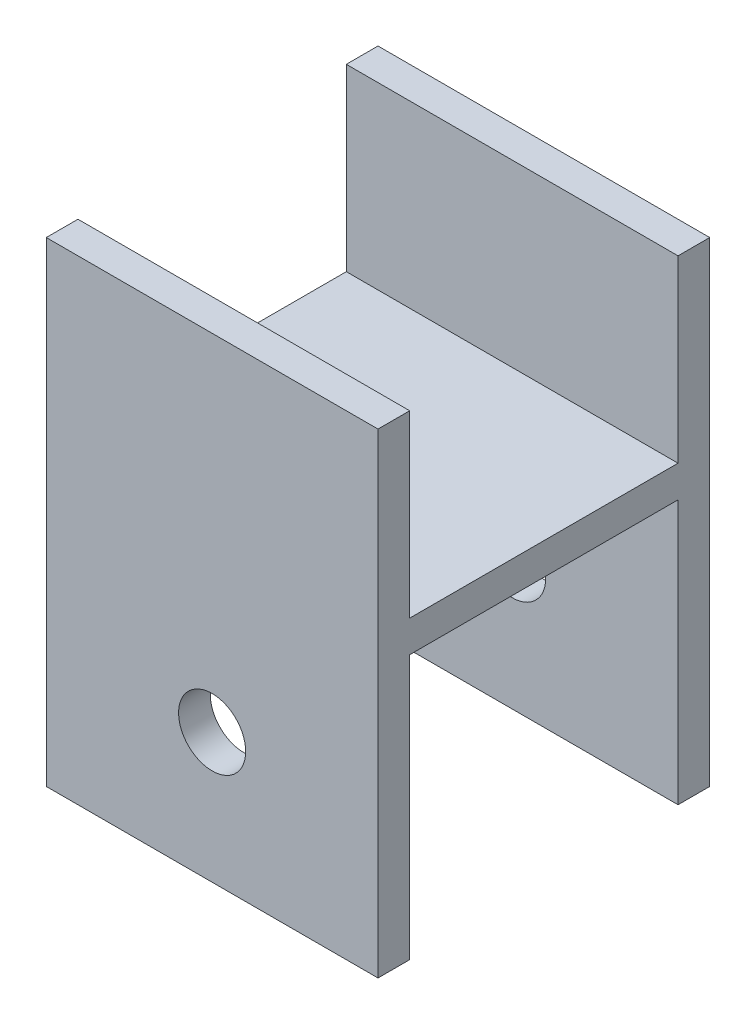
ISO-10303-21;
HEADER;
FILE_DESCRIPTION(('STEP AP214'),'2;1');
FILE_NAME('part.step','',(''),(''),'','','');
FILE_SCHEMA(('AUTOMOTIVE_DESIGN { 1 0 10303 214 1 1 1 1 }'));
ENDSEC;
DATA;
#1=APPLICATION_CONTEXT('core data for automotive mechanical design processes');
#2=APPLICATION_PROTOCOL_DEFINITION('international standard','automotive_design',2000,#1);
#3=PRODUCT_CONTEXT('',#1,'mechanical');
#4=PRODUCT('Part','Part','',(#3));
#5=PRODUCT_RELATED_PRODUCT_CATEGORY('part','',(#4));
#6=PRODUCT_DEFINITION_FORMATION('','',#4);
#7=PRODUCT_DEFINITION_CONTEXT('part definition',#1,'design');
#8=PRODUCT_DEFINITION('design','',#6,#7);
#9=PRODUCT_DEFINITION_SHAPE('','',#8);
#10=(LENGTH_UNIT() NAMED_UNIT(*) SI_UNIT(.MILLI.,.METRE.));
#11=(NAMED_UNIT(*) PLANE_ANGLE_UNIT() SI_UNIT($,.RADIAN.));
#12=(NAMED_UNIT(*) SI_UNIT($,.STERADIAN.) SOLID_ANGLE_UNIT());
#13=UNCERTAINTY_MEASURE_WITH_UNIT(LENGTH_MEASURE(1.E-05),#10,'distance_accuracy_value','');
#14=(GEOMETRIC_REPRESENTATION_CONTEXT(3) GLOBAL_UNCERTAINTY_ASSIGNED_CONTEXT((#13)) GLOBAL_UNIT_ASSIGNED_CONTEXT((#10,
#11,#12)) REPRESENTATION_CONTEXT('',''));
#15=CARTESIAN_POINT('',(0.,0.,0.));
#16=DIRECTION('',(0.,0.,1.));
#17=DIRECTION('',(1.,0.,0.));
#18=AXIS2_PLACEMENT_3D('',#15,#16,#17);
#19=CARTESIAN_POINT('',(31.4,0.,0.));
#20=DIRECTION('',(0.,0.,-1.));
#21=DIRECTION('',(-1.,0.,0.));
#22=AXIS2_PLACEMENT_3D('',#19,#20,#21);
#23=PLANE('',#22);
#24=DIRECTION('',(0.,-1.,0.));
#25=VECTOR('',#24,1.);
#26=CARTESIAN_POINT('',(0.,0.,0.));
#27=LINE('',#26,#25);
#28=CARTESIAN_POINT('',(0.,45.,0.));
#29=VERTEX_POINT('',#28);
#30=CARTESIAN_POINT('',(0.,0.,0.));
#31=VERTEX_POINT('',#30);
#32=EDGE_CURVE('E97',#29,#31,#27,.T.);
#33=ORIENTED_EDGE('',*,*,#32,.T.);
#34=DIRECTION('',(-1.,0.,0.));
#35=VECTOR('',#34,1.);
#36=CARTESIAN_POINT('',(31.4,0.,0.));
#37=LINE('',#36,#35);
#38=CARTESIAN_POINT('',(31.4,0.,0.));
#39=VERTEX_POINT('',#38);
#40=EDGE_CURVE('E150',#39,#31,#37,.T.);
#41=ORIENTED_EDGE('',*,*,#40,.F.);
#42=DIRECTION('',(0.,-1.,0.));
#43=VECTOR('',#42,1.);
#44=CARTESIAN_POINT('',(31.4,0.,0.));
#45=LINE('',#44,#43);
#46=CARTESIAN_POINT('',(31.4,45.,0.));
#47=VERTEX_POINT('',#46);
#48=EDGE_CURVE('E50',#47,#39,#45,.T.);
#49=ORIENTED_EDGE('',*,*,#48,.F.);
#50=DIRECTION('',(-1.,0.,0.));
#51=VECTOR('',#50,1.);
#52=CARTESIAN_POINT('',(31.4,45.,0.));
#53=LINE('',#52,#51);
#54=EDGE_CURVE('E146',#47,#29,#53,.T.);
#55=ORIENTED_EDGE('',*,*,#54,.T.);
#56=EDGE_LOOP('',(#33,#41,#49,#55));
#57=FACE_BOUND('',#56,.T.);
#58=CARTESIAN_POINT('',(15.7,12.3,0.));
#59=DIRECTION('',(0.,0.,1.));
#60=DIRECTION('',(1.,0.,0.));
#61=AXIS2_PLACEMENT_3D('',#58,#59,#60);
#62=CIRCLE('',#61,3.175);
#63=CARTESIAN_POINT('',(18.875,12.3,0.));
#64=VERTEX_POINT('',#63);
#65=EDGE_CURVE('E249',#64,#64,#62,.T.);
#66=ORIENTED_EDGE('',*,*,#65,.F.);
#67=EDGE_LOOP('',(#66));
#68=FACE_BOUND('',#67,.T.);
#69=ADVANCED_FACE('F33',(#57,#68),#23,.F.);
#70=CARTESIAN_POINT('',(31.4,0.,-3.));
#71=DIRECTION('',(0.,1.,0.));
#72=DIRECTION('',(0.,0.,1.));
#73=AXIS2_PLACEMENT_3D('',#70,#71,#72);
#74=PLANE('',#73);
#75=DIRECTION('',(0.,0.,-1.));
#76=VECTOR('',#75,1.);
#77=CARTESIAN_POINT('',(0.,0.,-3.));
#78=LINE('',#77,#76);
#79=CARTESIAN_POINT('',(0.,0.,-3.));
#80=VERTEX_POINT('',#79);
#81=EDGE_CURVE('E154',#31,#80,#78,.T.);
#82=ORIENTED_EDGE('',*,*,#81,.T.);
#83=DIRECTION('',(-1.,0.,0.));
#84=VECTOR('',#83,1.);
#85=CARTESIAN_POINT('',(31.4,0.,-3.));
#86=LINE('',#85,#84);
#87=CARTESIAN_POINT('',(31.4,0.,-3.));
#88=VERTEX_POINT('',#87);
#89=EDGE_CURVE('E11',#88,#80,#86,.T.);
#90=ORIENTED_EDGE('',*,*,#89,.F.);
#91=DIRECTION('',(0.,0.,-1.));
#92=VECTOR('',#91,1.);
#93=CARTESIAN_POINT('',(31.4,0.,-3.));
#94=LINE('',#93,#92);
#95=EDGE_CURVE('E177',#39,#88,#94,.T.);
#96=ORIENTED_EDGE('',*,*,#95,.F.);
#97=ORIENTED_EDGE('',*,*,#40,.T.);
#98=EDGE_LOOP('',(#82,#90,#96,#97));
#99=FACE_BOUND('',#98,.T.);
#100=ADVANCED_FACE('F35',(#99),#74,.F.);
#101=CARTESIAN_POINT('',(31.4,25.,-3.));
#102=DIRECTION('',(0.,0.,1.));
#103=DIRECTION('',(0.,-1.,0.));
#104=AXIS2_PLACEMENT_3D('',#101,#102,#103);
#105=PLANE('',#104);
#106=CARTESIAN_POINT('',(15.7,12.3,-3.));
#107=DIRECTION('',(0.,0.,1.));
#108=DIRECTION('',(0.,-1.,0.));
#109=AXIS2_PLACEMENT_3D('',#106,#107,#108);
#110=CIRCLE('',#109,3.175);
#111=CARTESIAN_POINT('',(15.7,9.125,-3.));
#112=VERTEX_POINT('',#111);
#113=EDGE_CURVE('E254',#112,#112,#110,.T.);
#114=ORIENTED_EDGE('',*,*,#113,.T.);
#115=EDGE_LOOP('',(#114));
#116=FACE_BOUND('',#115,.T.);
#117=DIRECTION('',(0.,1.,0.));
#118=VECTOR('',#117,1.);
#119=CARTESIAN_POINT('',(0.,25.,-3.));
#120=LINE('',#119,#118);
#121=CARTESIAN_POINT('',(0.,25.,-3.));
#122=VERTEX_POINT('',#121);
#123=EDGE_CURVE('E157',#80,#122,#120,.T.);
#124=ORIENTED_EDGE('',*,*,#123,.T.);
#125=DIRECTION('',(-1.,0.,0.));
#126=VECTOR('',#125,1.);
#127=CARTESIAN_POINT('',(31.4,25.,-3.));
#128=LINE('',#127,#126);
#129=CARTESIAN_POINT('',(31.4,25.,-3.));
#130=VERTEX_POINT('',#129);
#131=EDGE_CURVE('E42',#130,#122,#128,.T.);
#132=ORIENTED_EDGE('',*,*,#131,.F.);
#133=DIRECTION('',(0.,1.,0.));
#134=VECTOR('',#133,1.);
#135=CARTESIAN_POINT('',(31.4,25.,-3.));
#136=LINE('',#135,#134);
#137=EDGE_CURVE('E105',#88,#130,#136,.T.);
#138=ORIENTED_EDGE('',*,*,#137,.F.);
#139=ORIENTED_EDGE('',*,*,#89,.T.);
#140=EDGE_LOOP('',(#124,#132,#138,#139));
#141=FACE_BOUND('',#140,.T.);
#142=ADVANCED_FACE('F300',(#116,#141),#105,.F.);
#143=CARTESIAN_POINT('',(31.4,25.,-28.4));
#144=DIRECTION('',(0.,1.,0.));
#145=DIRECTION('',(0.,0.,1.));
#146=AXIS2_PLACEMENT_3D('',#143,#144,#145);
#147=PLANE('',#146);
#148=DIRECTION('',(0.,0.,-1.));
#149=VECTOR('',#148,1.);
#150=CARTESIAN_POINT('',(0.,25.,-28.4));
#151=LINE('',#150,#149);
#152=CARTESIAN_POINT('',(0.,25.,-28.4));
#153=VERTEX_POINT('',#152);
#154=EDGE_CURVE('E160',#122,#153,#151,.T.);
#155=ORIENTED_EDGE('',*,*,#154,.T.);
#156=DIRECTION('',(-1.,0.,0.));
#157=VECTOR('',#156,1.);
#158=CARTESIAN_POINT('',(31.4,25.,-28.4));
#159=LINE('',#158,#157);
#160=CARTESIAN_POINT('',(31.4,25.,-28.4));
#161=VERTEX_POINT('',#160);
#162=EDGE_CURVE('E196',#161,#153,#159,.T.);
#163=ORIENTED_EDGE('',*,*,#162,.F.);
#164=DIRECTION('',(0.,0.,-1.));
#165=VECTOR('',#164,1.);
#166=CARTESIAN_POINT('',(31.4,25.,-28.4));
#167=LINE('',#166,#165);
#168=EDGE_CURVE('E204',#130,#161,#167,.T.);
#169=ORIENTED_EDGE('',*,*,#168,.F.);
#170=ORIENTED_EDGE('',*,*,#131,.T.);
#171=EDGE_LOOP('',(#155,#163,#169,#170));
#172=FACE_BOUND('',#171,.T.);
#173=ADVANCED_FACE('F202',(#172),#147,.F.);
#174=CARTESIAN_POINT('',(31.4,0.,-28.4));
#175=DIRECTION('',(0.,0.,-1.));
#176=DIRECTION('',(-1.,0.,0.));
#177=AXIS2_PLACEMENT_3D('',#174,#175,#176);
#178=PLANE('',#177);
#179=CARTESIAN_POINT('',(15.7,12.3,-28.4));
#180=DIRECTION('',(0.,0.,-1.));
#181=DIRECTION('',(-1.,0.,0.));
#182=AXIS2_PLACEMENT_3D('',#179,#180,#181);
#183=CIRCLE('',#182,3.175);
#184=CARTESIAN_POINT('',(12.525,12.3,-28.4));
#185=VERTEX_POINT('',#184);
#186=EDGE_CURVE('E158',#185,#185,#183,.T.);
#187=ORIENTED_EDGE('',*,*,#186,.T.);
#188=EDGE_LOOP('',(#187));
#189=FACE_BOUND('',#188,.T.);
#190=DIRECTION('',(0.,-1.,0.));
#191=VECTOR('',#190,1.);
#192=CARTESIAN_POINT('',(0.,0.,-28.4));
#193=LINE('',#192,#191);
#194=CARTESIAN_POINT('',(0.,0.,-28.4));
#195=VERTEX_POINT('',#194);
#196=EDGE_CURVE('E162',#153,#195,#193,.T.);
#197=ORIENTED_EDGE('',*,*,#196,.T.);
#198=DIRECTION('',(-1.,0.,0.));
#199=VECTOR('',#198,1.);
#200=CARTESIAN_POINT('',(31.4,0.,-28.4));
#201=LINE('',#200,#199);
#202=CARTESIAN_POINT('',(31.4,0.,-28.4));
#203=VERTEX_POINT('',#202);
#204=EDGE_CURVE('E193',#203,#195,#201,.T.);
#205=ORIENTED_EDGE('',*,*,#204,.F.);
#206=DIRECTION('',(0.,-1.,0.));
#207=VECTOR('',#206,1.);
#208=CARTESIAN_POINT('',(31.4,0.,-28.4));
#209=LINE('',#208,#207);
#210=EDGE_CURVE('E222',#161,#203,#209,.T.);
#211=ORIENTED_EDGE('',*,*,#210,.F.);
#212=ORIENTED_EDGE('',*,*,#162,.T.);
#213=EDGE_LOOP('',(#197,#205,#211,#212));
#214=FACE_BOUND('',#213,.T.);
#215=ADVANCED_FACE('F213',(#189,#214),#178,.F.);
#216=CARTESIAN_POINT('',(31.4,0.,-31.4));
#217=DIRECTION('',(0.,1.,0.));
#218=DIRECTION('',(0.,0.,1.));
#219=AXIS2_PLACEMENT_3D('',#216,#217,#218);
#220=PLANE('',#219);
#221=DIRECTION('',(0.,0.,-1.));
#222=VECTOR('',#221,1.);
#223=CARTESIAN_POINT('',(0.,0.,-31.4));
#224=LINE('',#223,#222);
#225=CARTESIAN_POINT('',(0.,0.,-31.4));
#226=VERTEX_POINT('',#225);
#227=EDGE_CURVE('E164',#195,#226,#224,.T.);
#228=ORIENTED_EDGE('',*,*,#227,.T.);
#229=DIRECTION('',(-1.,0.,0.));
#230=VECTOR('',#229,1.);
#231=CARTESIAN_POINT('',(31.4,0.,-31.4));
#232=LINE('',#231,#230);
#233=CARTESIAN_POINT('',(31.4,0.,-31.4));
#234=VERTEX_POINT('',#233);
#235=EDGE_CURVE('E190',#234,#226,#232,.T.);
#236=ORIENTED_EDGE('',*,*,#235,.F.);
#237=DIRECTION('',(0.,0.,-1.));
#238=VECTOR('',#237,1.);
#239=CARTESIAN_POINT('',(31.4,0.,-31.4));
#240=LINE('',#239,#238);
#241=EDGE_CURVE('E219',#203,#234,#240,.T.);
#242=ORIENTED_EDGE('',*,*,#241,.F.);
#243=ORIENTED_EDGE('',*,*,#204,.T.);
#244=EDGE_LOOP('',(#228,#236,#242,#243));
#245=FACE_BOUND('',#244,.T.);
#246=ADVANCED_FACE('F217',(#245),#220,.F.);
#247=CARTESIAN_POINT('',(31.4,45.,-31.4));
#248=DIRECTION('',(0.,0.,1.));
#249=DIRECTION('',(0.,-1.,0.));
#250=AXIS2_PLACEMENT_3D('',#247,#248,#249);
#251=PLANE('',#250);
#252=CARTESIAN_POINT('',(15.7,12.3,-31.4));
#253=DIRECTION('',(0.,0.,1.));
#254=DIRECTION('',(1.,0.,0.));
#255=AXIS2_PLACEMENT_3D('',#252,#253,#254);
#256=CIRCLE('',#255,3.17499999999999);
#257=CARTESIAN_POINT('',(18.875,12.3,-31.4));
#258=VERTEX_POINT('',#257);
#259=EDGE_CURVE('E251',#258,#258,#256,.T.);
#260=ORIENTED_EDGE('',*,*,#259,.T.);
#261=EDGE_LOOP('',(#260));
#262=FACE_BOUND('',#261,.T.);
#263=DIRECTION('',(0.,1.,0.));
#264=VECTOR('',#263,1.);
#265=CARTESIAN_POINT('',(0.,45.,-31.4));
#266=LINE('',#265,#264);
#267=CARTESIAN_POINT('',(0.,45.,-31.4));
#268=VERTEX_POINT('',#267);
#269=EDGE_CURVE('E166',#226,#268,#266,.T.);
#270=ORIENTED_EDGE('',*,*,#269,.T.);
#271=DIRECTION('',(-1.,0.,0.));
#272=VECTOR('',#271,1.);
#273=CARTESIAN_POINT('',(31.4,45.,-31.4));
#274=LINE('',#273,#272);
#275=CARTESIAN_POINT('',(31.4,45.,-31.4));
#276=VERTEX_POINT('',#275);
#277=EDGE_CURVE('E187',#276,#268,#274,.T.);
#278=ORIENTED_EDGE('',*,*,#277,.F.);
#279=DIRECTION('',(0.,1.,0.));
#280=VECTOR('',#279,1.);
#281=CARTESIAN_POINT('',(31.4,45.,-31.4));
#282=LINE('',#281,#280);
#283=EDGE_CURVE('E221',#234,#276,#282,.T.);
#284=ORIENTED_EDGE('',*,*,#283,.F.);
#285=ORIENTED_EDGE('',*,*,#235,.T.);
#286=EDGE_LOOP('',(#270,#278,#284,#285));
#287=FACE_BOUND('',#286,.T.);
#288=ADVANCED_FACE('F290',(#262,#287),#251,.F.);
#289=CARTESIAN_POINT('',(31.4,45.,-28.4));
#290=DIRECTION('',(0.,-1.,0.));
#291=DIRECTION('',(0.,0.,-1.));
#292=AXIS2_PLACEMENT_3D('',#289,#290,#291);
#293=PLANE('',#292);
#294=DIRECTION('',(0.,0.,1.));
#295=VECTOR('',#294,1.);
#296=CARTESIAN_POINT('',(0.,45.,-28.4));
#297=LINE('',#296,#295);
#298=CARTESIAN_POINT('',(0.,45.,-28.4));
#299=VERTEX_POINT('',#298);
#300=EDGE_CURVE('E168',#268,#299,#297,.T.);
#301=ORIENTED_EDGE('',*,*,#300,.T.);
#302=DIRECTION('',(-1.,0.,0.));
#303=VECTOR('',#302,1.);
#304=CARTESIAN_POINT('',(31.4,45.,-28.4));
#305=LINE('',#304,#303);
#306=CARTESIAN_POINT('',(31.4,45.,-28.4));
#307=VERTEX_POINT('',#306);
#308=EDGE_CURVE('E184',#307,#299,#305,.T.);
#309=ORIENTED_EDGE('',*,*,#308,.F.);
#310=DIRECTION('',(0.,0.,1.));
#311=VECTOR('',#310,1.);
#312=CARTESIAN_POINT('',(31.4,45.,-28.4));
#313=LINE('',#312,#311);
#314=EDGE_CURVE('E224',#276,#307,#313,.T.);
#315=ORIENTED_EDGE('',*,*,#314,.F.);
#316=ORIENTED_EDGE('',*,*,#277,.T.);
#317=EDGE_LOOP('',(#301,#309,#315,#316));
#318=FACE_BOUND('',#317,.T.);
#319=ADVANCED_FACE('F287',(#318),#293,.F.);
#320=CARTESIAN_POINT('',(31.4,28.,-28.4));
#321=DIRECTION('',(0.,0.,-1.));
#322=DIRECTION('',(-1.,0.,0.));
#323=AXIS2_PLACEMENT_3D('',#320,#321,#322);
#324=PLANE('',#323);
#325=DIRECTION('',(0.,-1.,0.));
#326=VECTOR('',#325,1.);
#327=CARTESIAN_POINT('',(0.,28.,-28.4));
#328=LINE('',#327,#326);
#329=CARTESIAN_POINT('',(0.,28.,-28.4));
#330=VERTEX_POINT('',#329);
#331=EDGE_CURVE('E170',#299,#330,#328,.T.);
#332=ORIENTED_EDGE('',*,*,#331,.T.);
#333=DIRECTION('',(-1.,0.,0.));
#334=VECTOR('',#333,1.);
#335=CARTESIAN_POINT('',(31.4,28.,-28.4));
#336=LINE('',#335,#334);
#337=CARTESIAN_POINT('',(31.4,28.,-28.4));
#338=VERTEX_POINT('',#337);
#339=EDGE_CURVE('E181',#338,#330,#336,.T.);
#340=ORIENTED_EDGE('',*,*,#339,.F.);
#341=DIRECTION('',(0.,-1.,0.));
#342=VECTOR('',#341,1.);
#343=CARTESIAN_POINT('',(31.4,28.,-28.4));
#344=LINE('',#343,#342);
#345=EDGE_CURVE('E230',#307,#338,#344,.T.);
#346=ORIENTED_EDGE('',*,*,#345,.F.);
#347=ORIENTED_EDGE('',*,*,#308,.T.);
#348=EDGE_LOOP('',(#332,#340,#346,#347));
#349=FACE_BOUND('',#348,.T.);
#350=ADVANCED_FACE('F236',(#349),#324,.F.);
#351=CARTESIAN_POINT('',(31.4,28.,-3.));
#352=DIRECTION('',(0.,-1.,0.));
#353=DIRECTION('',(0.,0.,-1.));
#354=AXIS2_PLACEMENT_3D('',#351,#352,#353);
#355=PLANE('',#354);
#356=DIRECTION('',(0.,0.,1.));
#357=VECTOR('',#356,1.);
#358=CARTESIAN_POINT('',(0.,28.,-3.));
#359=LINE('',#358,#357);
#360=CARTESIAN_POINT('',(0.,28.,-3.));
#361=VERTEX_POINT('',#360);
#362=EDGE_CURVE('E172',#330,#361,#359,.T.);
#363=ORIENTED_EDGE('',*,*,#362,.T.);
#364=DIRECTION('',(-1.,0.,0.));
#365=VECTOR('',#364,1.);
#366=CARTESIAN_POINT('',(31.4,28.,-3.));
#367=LINE('',#366,#365);
#368=CARTESIAN_POINT('',(31.4,28.,-3.));
#369=VERTEX_POINT('',#368);
#370=EDGE_CURVE('E145',#369,#361,#367,.T.);
#371=ORIENTED_EDGE('',*,*,#370,.F.);
#372=DIRECTION('',(0.,0.,1.));
#373=VECTOR('',#372,1.);
#374=CARTESIAN_POINT('',(31.4,28.,-3.));
#375=LINE('',#374,#373);
#376=EDGE_CURVE('E136',#338,#369,#375,.T.);
#377=ORIENTED_EDGE('',*,*,#376,.F.);
#378=ORIENTED_EDGE('',*,*,#339,.T.);
#379=EDGE_LOOP('',(#363,#371,#377,#378));
#380=FACE_BOUND('',#379,.T.);
#381=ADVANCED_FACE('F240',(#380),#355,.F.);
#382=CARTESIAN_POINT('',(31.4,45.,-3.));
#383=DIRECTION('',(0.,0.,1.));
#384=DIRECTION('',(0.,-1.,0.));
#385=AXIS2_PLACEMENT_3D('',#382,#383,#384);
#386=PLANE('',#385);
#387=DIRECTION('',(0.,1.,0.));
#388=VECTOR('',#387,1.);
#389=CARTESIAN_POINT('',(0.,45.,-3.));
#390=LINE('',#389,#388);
#391=CARTESIAN_POINT('',(0.,45.,-3.));
#392=VERTEX_POINT('',#391);
#393=EDGE_CURVE('E144',#361,#392,#390,.T.);
#394=ORIENTED_EDGE('',*,*,#393,.T.);
#395=DIRECTION('',(-1.,0.,0.));
#396=VECTOR('',#395,1.);
#397=CARTESIAN_POINT('',(31.4,45.,-3.));
#398=LINE('',#397,#396);
#399=CARTESIAN_POINT('',(31.4,45.,-3.));
#400=VERTEX_POINT('',#399);
#401=EDGE_CURVE('E141',#400,#392,#398,.T.);
#402=ORIENTED_EDGE('',*,*,#401,.F.);
#403=DIRECTION('',(0.,1.,0.));
#404=VECTOR('',#403,1.);
#405=CARTESIAN_POINT('',(31.4,45.,-3.));
#406=LINE('',#405,#404);
#407=EDGE_CURVE('E130',#369,#400,#406,.T.);
#408=ORIENTED_EDGE('',*,*,#407,.F.);
#409=ORIENTED_EDGE('',*,*,#370,.T.);
#410=EDGE_LOOP('',(#394,#402,#408,#409));
#411=FACE_BOUND('',#410,.T.);
#412=ADVANCED_FACE('F142',(#411),#386,.F.);
#413=CARTESIAN_POINT('',(31.4,45.,0.));
#414=DIRECTION('',(0.,-1.,0.));
#415=DIRECTION('',(0.,0.,-1.));
#416=AXIS2_PLACEMENT_3D('',#413,#414,#415);
#417=PLANE('',#416);
#418=DIRECTION('',(0.,0.,1.));
#419=VECTOR('',#418,1.);
#420=CARTESIAN_POINT('',(0.,45.,0.));
#421=LINE('',#420,#419);
#422=EDGE_CURVE('E91',#392,#29,#421,.T.);
#423=ORIENTED_EDGE('',*,*,#422,.T.);
#424=ORIENTED_EDGE('',*,*,#54,.F.);
#425=DIRECTION('',(0.,0.,1.));
#426=VECTOR('',#425,1.);
#427=CARTESIAN_POINT('',(31.4,45.,0.));
#428=LINE('',#427,#426);
#429=EDGE_CURVE('E134',#400,#47,#428,.T.);
#430=ORIENTED_EDGE('',*,*,#429,.F.);
#431=ORIENTED_EDGE('',*,*,#401,.T.);
#432=EDGE_LOOP('',(#423,#424,#430,#431));
#433=FACE_BOUND('',#432,.T.);
#434=ADVANCED_FACE('F148',(#433),#417,.F.);
#435=CARTESIAN_POINT('',(31.4,0.,0.));
#436=DIRECTION('',(-1.,0.,0.));
#437=DIRECTION('',(0.,0.,1.));
#438=AXIS2_PLACEMENT_3D('',#435,#436,#437);
#439=PLANE('',#438);
#440=ORIENTED_EDGE('',*,*,#95,.T.);
#441=ORIENTED_EDGE('',*,*,#137,.T.);
#442=ORIENTED_EDGE('',*,*,#168,.T.);
#443=ORIENTED_EDGE('',*,*,#210,.T.);
#444=ORIENTED_EDGE('',*,*,#241,.T.);
#445=ORIENTED_EDGE('',*,*,#283,.T.);
#446=ORIENTED_EDGE('',*,*,#314,.T.);
#447=ORIENTED_EDGE('',*,*,#345,.T.);
#448=ORIENTED_EDGE('',*,*,#376,.T.);
#449=ORIENTED_EDGE('',*,*,#407,.T.);
#450=ORIENTED_EDGE('',*,*,#429,.T.);
#451=ORIENTED_EDGE('',*,*,#48,.T.);
#452=EDGE_LOOP('',(#440,#441,#442,#443,#444,#445,#446,#447,#448,#449,#450,#451));
#453=FACE_BOUND('',#452,.T.);
#454=ADVANCED_FACE('F132',(#453),#439,.F.);
#455=CARTESIAN_POINT('',(0.,0.,0.));
#456=DIRECTION('',(-1.,0.,0.));
#457=DIRECTION('',(0.,0.,1.));
#458=AXIS2_PLACEMENT_3D('',#455,#456,#457);
#459=PLANE('',#458);
#460=ORIENTED_EDGE('',*,*,#81,.F.);
#461=ORIENTED_EDGE('',*,*,#32,.F.);
#462=ORIENTED_EDGE('',*,*,#422,.F.);
#463=ORIENTED_EDGE('',*,*,#393,.F.);
#464=ORIENTED_EDGE('',*,*,#362,.F.);
#465=ORIENTED_EDGE('',*,*,#331,.F.);
#466=ORIENTED_EDGE('',*,*,#300,.F.);
#467=ORIENTED_EDGE('',*,*,#269,.F.);
#468=ORIENTED_EDGE('',*,*,#227,.F.);
#469=ORIENTED_EDGE('',*,*,#196,.F.);
#470=ORIENTED_EDGE('',*,*,#154,.F.);
#471=ORIENTED_EDGE('',*,*,#123,.F.);
#472=EDGE_LOOP('',(#460,#461,#462,#463,#464,#465,#466,#467,#468,#469,#470,#471));
#473=FACE_BOUND('',#472,.T.);
#474=ADVANCED_FACE('F208',(#473),#459,.T.);
#475=CARTESIAN_POINT('',(15.7,12.3,0.));
#476=DIRECTION('',(0.,0.,1.));
#477=DIRECTION('',(1.,0.,0.));
#478=AXIS2_PLACEMENT_3D('',#475,#476,#477);
#479=CYLINDRICAL_SURFACE('',#478,3.175);
#480=ORIENTED_EDGE('',*,*,#65,.T.);
#481=EDGE_LOOP('',(#480));
#482=FACE_BOUND('',#481,.T.);
#483=ORIENTED_EDGE('',*,*,#113,.F.);
#484=EDGE_LOOP('',(#483));
#485=FACE_BOUND('',#484,.T.);
#486=ADVANCED_FACE('F267',(#482,#485),#479,.F.);
#487=ORIENTED_EDGE('',*,*,#259,.F.);
#488=EDGE_LOOP('',(#487));
#489=FACE_BOUND('',#488,.T.);
#490=ORIENTED_EDGE('',*,*,#186,.F.);
#491=EDGE_LOOP('',(#490));
#492=FACE_BOUND('',#491,.T.);
#493=ADVANCED_FACE('F265',(#489,#492),#479,.F.);
#494=CLOSED_SHELL('',(#69,#100,#142,#173,#215,#246,#288,#319,#350,#381,#412,#434,#454,#474,#486,#493));
#495=MANIFOLD_SOLID_BREP('B2',#494);
#496=ADVANCED_BREP_SHAPE_REPRESENTATION('',(#18,#495),#14);
#497=SHAPE_DEFINITION_REPRESENTATION(#9,#496);
ENDSEC;
END-ISO-10303-21;
